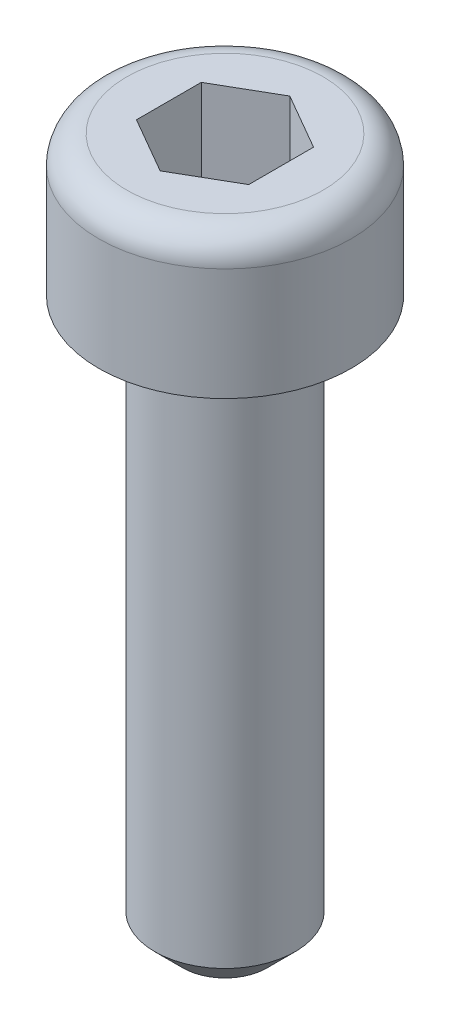
ISO-10303-21;
HEADER;
FILE_DESCRIPTION(('STEP AP214'),'2;1');
FILE_NAME('part.step','',(''),(''),'','','');
FILE_SCHEMA(('AUTOMOTIVE_DESIGN { 1 0 10303 214 1 1 1 1 }'));
ENDSEC;
DATA;
#1=APPLICATION_CONTEXT('core data for automotive mechanical design processes');
#2=APPLICATION_PROTOCOL_DEFINITION('international standard','automotive_design',2000,#1);
#3=PRODUCT_CONTEXT('',#1,'mechanical');
#4=PRODUCT('Part','Part','',(#3));
#5=PRODUCT_RELATED_PRODUCT_CATEGORY('part','',(#4));
#6=PRODUCT_DEFINITION_FORMATION('','',#4);
#7=PRODUCT_DEFINITION_CONTEXT('part definition',#1,'design');
#8=PRODUCT_DEFINITION('design','',#6,#7);
#9=PRODUCT_DEFINITION_SHAPE('','',#8);
#10=(LENGTH_UNIT() NAMED_UNIT(*) SI_UNIT(.MILLI.,.METRE.));
#11=(NAMED_UNIT(*) PLANE_ANGLE_UNIT() SI_UNIT($,.RADIAN.));
#12=(NAMED_UNIT(*) SI_UNIT($,.STERADIAN.) SOLID_ANGLE_UNIT());
#13=UNCERTAINTY_MEASURE_WITH_UNIT(LENGTH_MEASURE(1.E-05),#10,'distance_accuracy_value','');
#14=(GEOMETRIC_REPRESENTATION_CONTEXT(3) GLOBAL_UNCERTAINTY_ASSIGNED_CONTEXT((#13)) GLOBAL_UNIT_ASSIGNED_CONTEXT((#10,
#11,#12)) REPRESENTATION_CONTEXT('',''));
#15=CARTESIAN_POINT('',(0.,0.,0.));
#16=DIRECTION('',(0.,0.,1.));
#17=DIRECTION('',(1.,0.,0.));
#18=AXIS2_PLACEMENT_3D('',#15,#16,#17);
#19=CARTESIAN_POINT('',(0.,0.,0.));
#20=DIRECTION('',(0.,-1.,0.));
#21=DIRECTION('',(0.,0.,-1.));
#22=AXIS2_PLACEMENT_3D('',#19,#20,#21);
#23=PLANE('',#22);
#24=CARTESIAN_POINT('',(0.,0.,0.));
#25=DIRECTION('',(0.,-1.,0.));
#26=DIRECTION('',(0.,0.,-1.));
#27=AXIS2_PLACEMENT_3D('',#24,#25,#26);
#28=CIRCLE('',#27,1.75);
#29=CARTESIAN_POINT('',(0.,0.,-1.75));
#30=VERTEX_POINT('',#29);
#31=EDGE_CURVE('E51',#30,#30,#28,.F.);
#32=ORIENTED_EDGE('',*,*,#31,.T.);
#33=EDGE_LOOP('',(#32));
#34=FACE_BOUND('',#33,.T.);
#35=DIRECTION('',(-0.866025403784439,0.,-0.5));
#36=VECTOR('',#35,1.);
#37=CARTESIAN_POINT('',(1.,0.,-0.577350269189626));
#38=LINE('',#37,#36);
#39=CARTESIAN_POINT('',(1.,0.,-0.577350269189626));
#40=VERTEX_POINT('',#39);
#41=CARTESIAN_POINT('',(0.,0.,-1.15470053837925));
#42=VERTEX_POINT('',#41);
#43=EDGE_CURVE('E150',#40,#42,#38,.T.);
#44=ORIENTED_EDGE('',*,*,#43,.F.);
#45=DIRECTION('',(0.,0.,-1.));
#46=VECTOR('',#45,1.);
#47=CARTESIAN_POINT('',(1.,0.,0.577350269189626));
#48=LINE('',#47,#46);
#49=CARTESIAN_POINT('',(1.,0.,0.577350269189626));
#50=VERTEX_POINT('',#49);
#51=EDGE_CURVE('E61',#50,#40,#48,.T.);
#52=ORIENTED_EDGE('',*,*,#51,.F.);
#53=DIRECTION('',(0.866025403784439,0.,-0.5));
#54=VECTOR('',#53,1.);
#55=CARTESIAN_POINT('',(0.,0.,1.15470053837925));
#56=LINE('',#55,#54);
#57=CARTESIAN_POINT('',(0.,0.,1.15470053837925));
#58=VERTEX_POINT('',#57);
#59=EDGE_CURVE('E163',#58,#50,#56,.T.);
#60=ORIENTED_EDGE('',*,*,#59,.F.);
#61=DIRECTION('',(0.866025403784438,0.,0.5));
#62=VECTOR('',#61,1.);
#63=CARTESIAN_POINT('',(-0.999999999999999,0.,0.577350269189626));
#64=LINE('',#63,#62);
#65=CARTESIAN_POINT('',(-0.999999999999999,0.,0.577350269189626));
#66=VERTEX_POINT('',#65);
#67=EDGE_CURVE('E160',#66,#58,#64,.T.);
#68=ORIENTED_EDGE('',*,*,#67,.F.);
#69=DIRECTION('',(0.,0.,1.));
#70=VECTOR('',#69,1.);
#71=CARTESIAN_POINT('',(-0.999999999999999,0.,-0.577350269189626));
#72=LINE('',#71,#70);
#73=CARTESIAN_POINT('',(-0.999999999999999,0.,-0.577350269189626));
#74=VERTEX_POINT('',#73);
#75=EDGE_CURVE('E118',#74,#66,#72,.T.);
#76=ORIENTED_EDGE('',*,*,#75,.F.);
#77=DIRECTION('',(-0.866025403784439,0.,0.5));
#78=VECTOR('',#77,1.);
#79=CARTESIAN_POINT('',(0.,0.,-1.15470053837925));
#80=LINE('',#79,#78);
#81=EDGE_CURVE('E154',#42,#74,#80,.T.);
#82=ORIENTED_EDGE('',*,*,#81,.F.);
#83=EDGE_LOOP('',(#44,#52,#60,#68,#76,#82));
#84=FACE_BOUND('',#83,.T.);
#85=ADVANCED_FACE('F42',(#34,#84),#23,.F.);
#86=CARTESIAN_POINT('',(0.,0.,0.));
#87=DIRECTION('',(0.,1.,0.));
#88=DIRECTION('',(0.,0.,1.));
#89=AXIS2_PLACEMENT_3D('',#86,#87,#88);
#90=CYLINDRICAL_SURFACE('',#89,2.25);
#91=CARTESIAN_POINT('',(0.,-0.5,0.));
#92=DIRECTION('',(0.,-1.,0.));
#93=DIRECTION('',(0.,0.,-1.));
#94=AXIS2_PLACEMENT_3D('',#91,#92,#93);
#95=CIRCLE('',#94,2.25);
#96=CARTESIAN_POINT('',(0.,-0.5,-2.25));
#97=VERTEX_POINT('',#96);
#98=EDGE_CURVE('E11',#97,#97,#95,.T.);
#99=ORIENTED_EDGE('',*,*,#98,.T.);
#100=EDGE_LOOP('',(#99));
#101=FACE_BOUND('',#100,.T.);
#102=CARTESIAN_POINT('',(0.,-2.5,0.));
#103=DIRECTION('',(0.,1.,0.));
#104=DIRECTION('',(0.,0.,1.));
#105=AXIS2_PLACEMENT_3D('',#102,#103,#104);
#106=CIRCLE('',#105,2.25);
#107=CARTESIAN_POINT('',(0.,-2.5,2.25));
#108=VERTEX_POINT('',#107);
#109=EDGE_CURVE('E182',#108,#108,#106,.T.);
#110=ORIENTED_EDGE('',*,*,#109,.T.);
#111=EDGE_LOOP('',(#110));
#112=FACE_BOUND('',#111,.T.);
#113=ADVANCED_FACE('F208',(#101,#112),#90,.T.);
#114=CARTESIAN_POINT('',(2.25,-2.5,0.));
#115=DIRECTION('',(0.,1.,0.));
#116=DIRECTION('',(0.,0.,1.));
#117=AXIS2_PLACEMENT_3D('',#114,#115,#116);
#118=PLANE('',#117);
#119=ORIENTED_EDGE('',*,*,#109,.F.);
#120=EDGE_LOOP('',(#119));
#121=FACE_BOUND('',#120,.T.);
#122=CARTESIAN_POINT('',(0.,-2.5,0.));
#123=DIRECTION('',(0.,1.,0.));
#124=DIRECTION('',(0.,0.,1.));
#125=AXIS2_PLACEMENT_3D('',#122,#123,#124);
#126=CIRCLE('',#125,1.25);
#127=CARTESIAN_POINT('',(0.,-2.5,1.25));
#128=VERTEX_POINT('',#127);
#129=EDGE_CURVE('E169',#128,#128,#126,.T.);
#130=ORIENTED_EDGE('',*,*,#129,.T.);
#131=EDGE_LOOP('',(#130));
#132=FACE_BOUND('',#131,.T.);
#133=ADVANCED_FACE('F213',(#121,#132),#118,.F.);
#134=CARTESIAN_POINT('',(0.,0.,0.));
#135=DIRECTION('',(0.,1.,0.));
#136=DIRECTION('',(0.,0.,1.));
#137=AXIS2_PLACEMENT_3D('',#134,#135,#136);
#138=CYLINDRICAL_SURFACE('',#137,1.25);
#139=CARTESIAN_POINT('',(0.,-12.,0.));
#140=DIRECTION('',(0.,1.,0.));
#141=DIRECTION('',(0.,0.,1.));
#142=AXIS2_PLACEMENT_3D('',#139,#140,#141);
#143=CIRCLE('',#142,1.25);
#144=CARTESIAN_POINT('',(0.,-12.,1.25));
#145=VERTEX_POINT('',#144);
#146=EDGE_CURVE('E186',#145,#145,#143,.T.);
#147=ORIENTED_EDGE('',*,*,#146,.T.);
#148=EDGE_LOOP('',(#147));
#149=FACE_BOUND('',#148,.T.);
#150=ORIENTED_EDGE('',*,*,#129,.F.);
#151=EDGE_LOOP('',(#150));
#152=FACE_BOUND('',#151,.T.);
#153=ADVANCED_FACE('F219',(#149,#152),#138,.T.);
#154=CARTESIAN_POINT('',(1.25,-12.5,0.));
#155=DIRECTION('',(0.,1.,0.));
#156=DIRECTION('',(0.,0.,1.));
#157=AXIS2_PLACEMENT_3D('',#154,#155,#156);
#158=PLANE('',#157);
#159=CARTESIAN_POINT('',(0.,-12.5,0.));
#160=DIRECTION('',(0.,1.,0.));
#161=DIRECTION('',(0.,0.,1.));
#162=AXIS2_PLACEMENT_3D('',#159,#160,#161);
#163=CIRCLE('',#162,0.750000000000002);
#164=CARTESIAN_POINT('',(0.,-12.5,0.750000000000002));
#165=VERTEX_POINT('',#164);
#166=EDGE_CURVE('E190',#165,#165,#163,.F.);
#167=ORIENTED_EDGE('',*,*,#166,.T.);
#168=EDGE_LOOP('',(#167));
#169=FACE_BOUND('',#168,.T.);
#170=ADVANCED_FACE('F223',(#169),#158,.F.);
#171=CARTESIAN_POINT('',(1.,-2.,0.577350269189626));
#172=DIRECTION('',(1.,0.,0.));
#173=DIRECTION('',(0.,0.,-1.));
#174=AXIS2_PLACEMENT_3D('',#171,#172,#173);
#175=PLANE('',#174);
#176=ORIENTED_EDGE('',*,*,#51,.T.);
#177=DIRECTION('',(0.,1.,0.));
#178=VECTOR('',#177,1.);
#179=CARTESIAN_POINT('',(1.,-2.,-0.577350269189626));
#180=LINE('',#179,#178);
#181=CARTESIAN_POINT('',(1.,-2.,-0.577350269189626));
#182=VERTEX_POINT('',#181);
#183=EDGE_CURVE('E99',#182,#40,#180,.T.);
#184=ORIENTED_EDGE('',*,*,#183,.F.);
#185=DIRECTION('',(0.,0.,-1.));
#186=VECTOR('',#185,1.);
#187=CARTESIAN_POINT('',(1.,-2.,0.577350269189626));
#188=LINE('',#187,#186);
#189=CARTESIAN_POINT('',(1.,-2.,0.577350269189626));
#190=VERTEX_POINT('',#189);
#191=EDGE_CURVE('E166',#190,#182,#188,.T.);
#192=ORIENTED_EDGE('',*,*,#191,.F.);
#193=DIRECTION('',(0.,1.,0.));
#194=VECTOR('',#193,1.);
#195=CARTESIAN_POINT('',(1.,-2.,0.577350269189626));
#196=LINE('',#195,#194);
#197=EDGE_CURVE('E72',#190,#50,#196,.T.);
#198=ORIENTED_EDGE('',*,*,#197,.T.);
#199=EDGE_LOOP('',(#176,#184,#192,#198));
#200=FACE_BOUND('',#199,.T.);
#201=ADVANCED_FACE('F227',(#200),#175,.F.);
#202=CARTESIAN_POINT('',(0.,-2.,1.15470053837925));
#203=DIRECTION('',(0.5,0.,0.866025403784439));
#204=DIRECTION('',(0.866025403784439,0.,-0.5));
#205=AXIS2_PLACEMENT_3D('',#202,#203,#204);
#206=PLANE('',#205);
#207=ORIENTED_EDGE('',*,*,#59,.T.);
#208=ORIENTED_EDGE('',*,*,#197,.F.);
#209=DIRECTION('',(0.866025403784439,0.,-0.5));
#210=VECTOR('',#209,1.);
#211=CARTESIAN_POINT('',(0.,-2.,1.15470053837925));
#212=LINE('',#211,#210);
#213=CARTESIAN_POINT('',(0.,-2.,1.15470053837925));
#214=VERTEX_POINT('',#213);
#215=EDGE_CURVE('E132',#214,#190,#212,.T.);
#216=ORIENTED_EDGE('',*,*,#215,.F.);
#217=DIRECTION('',(0.,1.,0.));
#218=VECTOR('',#217,1.);
#219=CARTESIAN_POINT('',(0.,-2.,1.15470053837925));
#220=LINE('',#219,#218);
#221=EDGE_CURVE('E123',#214,#58,#220,.T.);
#222=ORIENTED_EDGE('',*,*,#221,.T.);
#223=EDGE_LOOP('',(#207,#208,#216,#222));
#224=FACE_BOUND('',#223,.T.);
#225=ADVANCED_FACE('F231',(#224),#206,.F.);
#226=CARTESIAN_POINT('',(-0.999999999999999,-2.,0.577350269189626));
#227=DIRECTION('',(-0.5,0.,0.866025403784439));
#228=DIRECTION('',(0.866025403784438,0.,0.5));
#229=AXIS2_PLACEMENT_3D('',#226,#227,#228);
#230=PLANE('',#229);
#231=ORIENTED_EDGE('',*,*,#67,.T.);
#232=ORIENTED_EDGE('',*,*,#221,.F.);
#233=DIRECTION('',(0.866025403784438,0.,0.5));
#234=VECTOR('',#233,1.);
#235=CARTESIAN_POINT('',(-0.999999999999999,-2.,0.577350269189626));
#236=LINE('',#235,#234);
#237=CARTESIAN_POINT('',(-0.999999999999999,-2.,0.577350269189626));
#238=VERTEX_POINT('',#237);
#239=EDGE_CURVE('E127',#238,#214,#236,.T.);
#240=ORIENTED_EDGE('',*,*,#239,.F.);
#241=DIRECTION('',(0.,1.,0.));
#242=VECTOR('',#241,1.);
#243=CARTESIAN_POINT('',(-0.999999999999999,-2.,0.577350269189626));
#244=LINE('',#243,#242);
#245=EDGE_CURVE('E111',#238,#66,#244,.T.);
#246=ORIENTED_EDGE('',*,*,#245,.T.);
#247=EDGE_LOOP('',(#231,#232,#240,#246));
#248=FACE_BOUND('',#247,.T.);
#249=ADVANCED_FACE('F128',(#248),#230,.F.);
#250=CARTESIAN_POINT('',(-0.999999999999999,-2.,-0.577350269189626));
#251=DIRECTION('',(-1.,0.,0.));
#252=DIRECTION('',(0.,0.,1.));
#253=AXIS2_PLACEMENT_3D('',#250,#251,#252);
#254=PLANE('',#253);
#255=ORIENTED_EDGE('',*,*,#75,.T.);
#256=ORIENTED_EDGE('',*,*,#245,.F.);
#257=DIRECTION('',(0.,0.,1.));
#258=VECTOR('',#257,1.);
#259=CARTESIAN_POINT('',(-0.999999999999999,-2.,-0.577350269189626));
#260=LINE('',#259,#258);
#261=CARTESIAN_POINT('',(-0.999999999999999,-2.,-0.577350269189626));
#262=VERTEX_POINT('',#261);
#263=EDGE_CURVE('E115',#262,#238,#260,.T.);
#264=ORIENTED_EDGE('',*,*,#263,.F.);
#265=DIRECTION('',(0.,1.,0.));
#266=VECTOR('',#265,1.);
#267=CARTESIAN_POINT('',(-0.999999999999999,-2.,-0.577350269189626));
#268=LINE('',#267,#266);
#269=EDGE_CURVE('E124',#262,#74,#268,.T.);
#270=ORIENTED_EDGE('',*,*,#269,.T.);
#271=EDGE_LOOP('',(#255,#256,#264,#270));
#272=FACE_BOUND('',#271,.T.);
#273=ADVANCED_FACE('F113',(#272),#254,.F.);
#274=CARTESIAN_POINT('',(0.,-2.,-1.15470053837925));
#275=DIRECTION('',(-0.5,0.,-0.866025403784439));
#276=DIRECTION('',(-0.866025403784439,0.,0.5));
#277=AXIS2_PLACEMENT_3D('',#274,#275,#276);
#278=PLANE('',#277);
#279=ORIENTED_EDGE('',*,*,#81,.T.);
#280=ORIENTED_EDGE('',*,*,#269,.F.);
#281=DIRECTION('',(-0.866025403784439,0.,0.5));
#282=VECTOR('',#281,1.);
#283=CARTESIAN_POINT('',(0.,-2.,-1.15470053837925));
#284=LINE('',#283,#282);
#285=CARTESIAN_POINT('',(0.,-2.,-1.15470053837925));
#286=VERTEX_POINT('',#285);
#287=EDGE_CURVE('E138',#286,#262,#284,.T.);
#288=ORIENTED_EDGE('',*,*,#287,.F.);
#289=DIRECTION('',(0.,1.,0.));
#290=VECTOR('',#289,1.);
#291=CARTESIAN_POINT('',(0.,-2.,-1.15470053837925));
#292=LINE('',#291,#290);
#293=EDGE_CURVE('E174',#286,#42,#292,.T.);
#294=ORIENTED_EDGE('',*,*,#293,.T.);
#295=EDGE_LOOP('',(#279,#280,#288,#294));
#296=FACE_BOUND('',#295,.T.);
#297=ADVANCED_FACE('F235',(#296),#278,.F.);
#298=CARTESIAN_POINT('',(1.,-2.,-0.577350269189626));
#299=DIRECTION('',(0.5,0.,-0.866025403784439));
#300=DIRECTION('',(-0.866025403784439,0.,-0.5));
#301=AXIS2_PLACEMENT_3D('',#298,#299,#300);
#302=PLANE('',#301);
#303=ORIENTED_EDGE('',*,*,#43,.T.);
#304=ORIENTED_EDGE('',*,*,#293,.F.);
#305=DIRECTION('',(-0.866025403784439,0.,-0.5));
#306=VECTOR('',#305,1.);
#307=CARTESIAN_POINT('',(1.,-2.,-0.577350269189626));
#308=LINE('',#307,#306);
#309=EDGE_CURVE('E142',#182,#286,#308,.T.);
#310=ORIENTED_EDGE('',*,*,#309,.F.);
#311=ORIENTED_EDGE('',*,*,#183,.T.);
#312=EDGE_LOOP('',(#303,#304,#310,#311));
#313=FACE_BOUND('',#312,.T.);
#314=ADVANCED_FACE('F232',(#313),#302,.F.);
#315=CARTESIAN_POINT('',(1.,-2.,-0.577350269189626));
#316=DIRECTION('',(0.,1.,0.));
#317=DIRECTION('',(0.,0.,1.));
#318=AXIS2_PLACEMENT_3D('',#315,#316,#317);
#319=PLANE('',#318);
#320=ORIENTED_EDGE('',*,*,#191,.T.);
#321=ORIENTED_EDGE('',*,*,#309,.T.);
#322=ORIENTED_EDGE('',*,*,#287,.T.);
#323=ORIENTED_EDGE('',*,*,#263,.T.);
#324=ORIENTED_EDGE('',*,*,#239,.T.);
#325=ORIENTED_EDGE('',*,*,#215,.T.);
#326=EDGE_LOOP('',(#320,#321,#322,#323,#324,#325));
#327=FACE_BOUND('',#326,.T.);
#328=ADVANCED_FACE('F135',(#327),#319,.T.);
#329=CARTESIAN_POINT('',(0.,-12.,0.));
#330=DIRECTION('',(0.,1.,0.));
#331=DIRECTION('',(0.,0.,1.));
#332=AXIS2_PLACEMENT_3D('',#329,#330,#331);
#333=CONICAL_SURFACE('',#332,1.25,0.78539816339745);
#334=ORIENTED_EDGE('',*,*,#166,.F.);
#335=EDGE_LOOP('',(#334));
#336=FACE_BOUND('',#335,.T.);
#337=ORIENTED_EDGE('',*,*,#146,.F.);
#338=EDGE_LOOP('',(#337));
#339=FACE_BOUND('',#338,.T.);
#340=ADVANCED_FACE('F200',(#336,#339),#333,.T.);
#341=CARTESIAN_POINT('',(0.,-0.5,0.));
#342=DIRECTION('',(0.,-1.,0.));
#343=DIRECTION('',(0.,0.,-1.));
#344=AXIS2_PLACEMENT_3D('',#341,#342,#343);
#345=TOROIDAL_SURFACE('',#344,1.75,0.5);
#346=ORIENTED_EDGE('',*,*,#98,.F.);
#347=EDGE_LOOP('',(#346));
#348=FACE_BOUND('',#347,.T.);
#349=ORIENTED_EDGE('',*,*,#31,.F.);
#350=EDGE_LOOP('',(#349));
#351=FACE_BOUND('',#350,.T.);
#352=ADVANCED_FACE('F44',(#348,#351),#345,.T.);
#353=CLOSED_SHELL('',(#85,#113,#133,#153,#170,#201,#225,#249,#273,#297,#314,#328,#340,#352));
#354=MANIFOLD_SOLID_BREP('B2',#353);
#355=ADVANCED_BREP_SHAPE_REPRESENTATION('',(#18,#354),#14);
#356=SHAPE_DEFINITION_REPRESENTATION(#9,#355);
ENDSEC;
END-ISO-10303-21;
